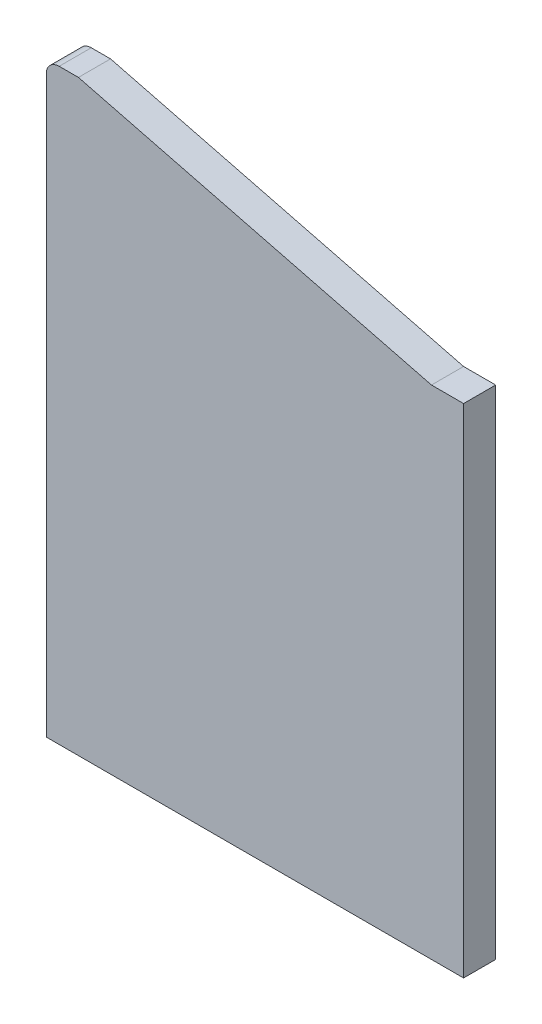
ISO-10303-21;
HEADER;
FILE_DESCRIPTION(('STEP AP214'),'2;1');
FILE_NAME('part.step','',(''),(''),'','','');
FILE_SCHEMA(('AUTOMOTIVE_DESIGN { 1 0 10303 214 1 1 1 1 }'));
ENDSEC;
DATA;
#1=APPLICATION_CONTEXT('core data for automotive mechanical design processes');
#2=APPLICATION_PROTOCOL_DEFINITION('international standard','automotive_design',2000,#1);
#3=PRODUCT_CONTEXT('',#1,'mechanical');
#4=PRODUCT('Part','Part','',(#3));
#5=PRODUCT_RELATED_PRODUCT_CATEGORY('part','',(#4));
#6=PRODUCT_DEFINITION_FORMATION('','',#4);
#7=PRODUCT_DEFINITION_CONTEXT('part definition',#1,'design');
#8=PRODUCT_DEFINITION('design','',#6,#7);
#9=PRODUCT_DEFINITION_SHAPE('','',#8);
#10=(LENGTH_UNIT() NAMED_UNIT(*) SI_UNIT(.MILLI.,.METRE.));
#11=(NAMED_UNIT(*) PLANE_ANGLE_UNIT() SI_UNIT($,.RADIAN.));
#12=(NAMED_UNIT(*) SI_UNIT($,.STERADIAN.) SOLID_ANGLE_UNIT());
#13=UNCERTAINTY_MEASURE_WITH_UNIT(LENGTH_MEASURE(1.E-05),#10,'distance_accuracy_value','');
#14=(GEOMETRIC_REPRESENTATION_CONTEXT(3) GLOBAL_UNCERTAINTY_ASSIGNED_CONTEXT((#13)) GLOBAL_UNIT_ASSIGNED_CONTEXT((#10,
#11,#12)) REPRESENTATION_CONTEXT('',''));
#15=CARTESIAN_POINT('',(0.,0.,0.));
#16=DIRECTION('',(0.,0.,1.));
#17=DIRECTION('',(1.,0.,0.));
#18=AXIS2_PLACEMENT_3D('',#15,#16,#17);
#19=CARTESIAN_POINT('',(0.,0.,10.));
#20=DIRECTION('',(1.,0.,0.));
#21=DIRECTION('',(0.,1.,0.));
#22=AXIS2_PLACEMENT_3D('',#19,#20,#21);
#23=PLANE('',#22);
#24=DIRECTION('',(0.,-1.,0.));
#25=VECTOR('',#24,1.);
#26=CARTESIAN_POINT('',(0.,0.,10.));
#27=LINE('',#26,#25);
#28=CARTESIAN_POINT('',(0.,179.,10.));
#29=VERTEX_POINT('',#28);
#30=CARTESIAN_POINT('',(0.,0.,10.));
#31=VERTEX_POINT('',#30);
#32=EDGE_CURVE('E91',#29,#31,#27,.T.);
#33=ORIENTED_EDGE('',*,*,#32,.F.);
#34=DIRECTION('',(0.,0.,-1.));
#35=VECTOR('',#34,1.);
#36=CARTESIAN_POINT('',(0.,179.,10.));
#37=LINE('',#36,#35);
#38=CARTESIAN_POINT('',(0.,179.,0.));
#39=VERTEX_POINT('',#38);
#40=EDGE_CURVE('E114',#29,#39,#37,.T.);
#41=ORIENTED_EDGE('',*,*,#40,.T.);
#42=DIRECTION('',(0.,-1.,0.));
#43=VECTOR('',#42,1.);
#44=CARTESIAN_POINT('',(0.,0.,0.));
#45=LINE('',#44,#43);
#46=CARTESIAN_POINT('',(0.,0.,0.));
#47=VERTEX_POINT('',#46);
#48=EDGE_CURVE('E112',#39,#47,#45,.T.);
#49=ORIENTED_EDGE('',*,*,#48,.T.);
#50=DIRECTION('',(0.,0.,-1.));
#51=VECTOR('',#50,1.);
#52=CARTESIAN_POINT('',(0.,0.,10.));
#53=LINE('',#52,#51);
#54=EDGE_CURVE('E106',#31,#47,#53,.T.);
#55=ORIENTED_EDGE('',*,*,#54,.F.);
#56=EDGE_LOOP('',(#33,#41,#49,#55));
#57=FACE_BOUND('',#56,.T.);
#58=ADVANCED_FACE('F33',(#57),#23,.F.);
#59=CARTESIAN_POINT('',(130.,-1.11022302462516E-13,10.));
#60=DIRECTION('',(0.,1.,0.));
#61=DIRECTION('',(-1.,0.,0.));
#62=AXIS2_PLACEMENT_3D('',#59,#60,#61);
#63=PLANE('',#62);
#64=DIRECTION('',(1.,0.,0.));
#65=VECTOR('',#64,1.);
#66=CARTESIAN_POINT('',(130.,-1.11022302462516E-13,0.));
#67=LINE('',#66,#65);
#68=CARTESIAN_POINT('',(130.,-1.11022302462516E-13,0.));
#69=VERTEX_POINT('',#68);
#70=EDGE_CURVE('E137',#47,#69,#67,.T.);
#71=ORIENTED_EDGE('',*,*,#70,.T.);
#72=DIRECTION('',(0.,0.,-1.));
#73=VECTOR('',#72,1.);
#74=CARTESIAN_POINT('',(130.,-1.11022302462516E-13,10.));
#75=LINE('',#74,#73);
#76=CARTESIAN_POINT('',(130.,-1.11022302462516E-13,10.));
#77=VERTEX_POINT('',#76);
#78=EDGE_CURVE('E108',#77,#69,#75,.T.);
#79=ORIENTED_EDGE('',*,*,#78,.F.);
#80=DIRECTION('',(1.,0.,0.));
#81=VECTOR('',#80,1.);
#82=CARTESIAN_POINT('',(130.,-1.11022302462516E-13,10.));
#83=LINE('',#82,#81);
#84=EDGE_CURVE('E94',#31,#77,#83,.T.);
#85=ORIENTED_EDGE('',*,*,#84,.F.);
#86=ORIENTED_EDGE('',*,*,#54,.T.);
#87=EDGE_LOOP('',(#71,#79,#85,#86));
#88=FACE_BOUND('',#87,.T.);
#89=ADVANCED_FACE('F105',(#88),#63,.F.);
#90=CARTESIAN_POINT('',(130.,155.,10.));
#91=DIRECTION('',(-1.,0.,0.));
#92=DIRECTION('',(0.,-1.,0.));
#93=AXIS2_PLACEMENT_3D('',#90,#91,#92);
#94=PLANE('',#93);
#95=DIRECTION('',(0.,1.,0.));
#96=VECTOR('',#95,1.);
#97=CARTESIAN_POINT('',(130.,155.,0.));
#98=LINE('',#97,#96);
#99=CARTESIAN_POINT('',(130.,155.,0.));
#100=VERTEX_POINT('',#99);
#101=EDGE_CURVE('E135',#69,#100,#98,.T.);
#102=ORIENTED_EDGE('',*,*,#101,.T.);
#103=DIRECTION('',(0.,0.,-1.));
#104=VECTOR('',#103,1.);
#105=CARTESIAN_POINT('',(130.,155.,10.));
#106=LINE('',#105,#104);
#107=CARTESIAN_POINT('',(130.,155.,10.));
#108=VERTEX_POINT('',#107);
#109=EDGE_CURVE('E117',#108,#100,#106,.T.);
#110=ORIENTED_EDGE('',*,*,#109,.F.);
#111=DIRECTION('',(0.,1.,0.));
#112=VECTOR('',#111,1.);
#113=CARTESIAN_POINT('',(130.,155.,10.));
#114=LINE('',#113,#112);
#115=EDGE_CURVE('E110',#77,#108,#114,.T.);
#116=ORIENTED_EDGE('',*,*,#115,.F.);
#117=ORIENTED_EDGE('',*,*,#78,.T.);
#118=EDGE_LOOP('',(#102,#110,#116,#117));
#119=FACE_BOUND('',#118,.T.);
#120=ADVANCED_FACE('F149',(#119),#94,.F.);
#121=CARTESIAN_POINT('',(120.,155.,10.));
#122=DIRECTION('',(0.,-1.,0.));
#123=DIRECTION('',(1.,0.,0.));
#124=AXIS2_PLACEMENT_3D('',#121,#122,#123);
#125=PLANE('',#124);
#126=DIRECTION('',(-1.,0.,0.));
#127=VECTOR('',#126,1.);
#128=CARTESIAN_POINT('',(120.,155.,0.));
#129=LINE('',#128,#127);
#130=CARTESIAN_POINT('',(120.,155.,0.));
#131=VERTEX_POINT('',#130);
#132=EDGE_CURVE('E133',#100,#131,#129,.T.);
#133=ORIENTED_EDGE('',*,*,#132,.T.);
#134=DIRECTION('',(0.,0.,-1.));
#135=VECTOR('',#134,1.);
#136=CARTESIAN_POINT('',(120.,155.,10.));
#137=LINE('',#136,#135);
#138=CARTESIAN_POINT('',(120.,155.,10.));
#139=VERTEX_POINT('',#138);
#140=EDGE_CURVE('E123',#139,#131,#137,.T.);
#141=ORIENTED_EDGE('',*,*,#140,.F.);
#142=DIRECTION('',(-1.,0.,0.));
#143=VECTOR('',#142,1.);
#144=CARTESIAN_POINT('',(120.,155.,10.));
#145=LINE('',#144,#143);
#146=EDGE_CURVE('E143',#108,#139,#145,.T.);
#147=ORIENTED_EDGE('',*,*,#146,.F.);
#148=ORIENTED_EDGE('',*,*,#109,.T.);
#149=EDGE_LOOP('',(#133,#141,#147,#148));
#150=FACE_BOUND('',#149,.T.);
#151=ADVANCED_FACE('F153',(#150),#125,.F.);
#152=CARTESIAN_POINT('',(10.,183.,10.));
#153=DIRECTION('',(-0.246679280634931,-0.969097173922942,0.));
#154=DIRECTION('',(0.969097173922942,-0.246679280634931,0.));
#155=AXIS2_PLACEMENT_3D('',#152,#153,#154);
#156=PLANE('',#155);
#157=DIRECTION('',(-0.969097173922942,0.246679280634931,0.));
#158=VECTOR('',#157,1.);
#159=CARTESIAN_POINT('',(10.,183.,0.));
#160=LINE('',#159,#158);
#161=CARTESIAN_POINT('',(10.,183.,0.));
#162=VERTEX_POINT('',#161);
#163=EDGE_CURVE('E131',#131,#162,#160,.T.);
#164=ORIENTED_EDGE('',*,*,#163,.T.);
#165=DIRECTION('',(0.,0.,-1.));
#166=VECTOR('',#165,1.);
#167=CARTESIAN_POINT('',(10.,183.,10.));
#168=LINE('',#167,#166);
#169=CARTESIAN_POINT('',(10.,183.,10.));
#170=VERTEX_POINT('',#169);
#171=EDGE_CURVE('E126',#170,#162,#168,.T.);
#172=ORIENTED_EDGE('',*,*,#171,.F.);
#173=DIRECTION('',(-0.969097173922942,0.246679280634931,0.));
#174=VECTOR('',#173,1.);
#175=CARTESIAN_POINT('',(10.,183.,10.));
#176=LINE('',#175,#174);
#177=EDGE_CURVE('E141',#139,#170,#176,.T.);
#178=ORIENTED_EDGE('',*,*,#177,.F.);
#179=ORIENTED_EDGE('',*,*,#140,.T.);
#180=EDGE_LOOP('',(#164,#172,#178,#179));
#181=FACE_BOUND('',#180,.T.);
#182=ADVANCED_FACE('F158',(#181),#156,.F.);
#183=CARTESIAN_POINT('',(0.,183.,10.));
#184=DIRECTION('',(0.,-1.,0.));
#185=DIRECTION('',(1.,0.,0.));
#186=AXIS2_PLACEMENT_3D('',#183,#184,#185);
#187=PLANE('',#186);
#188=DIRECTION('',(-1.,0.,0.));
#189=VECTOR('',#188,1.);
#190=CARTESIAN_POINT('',(0.,183.,0.));
#191=LINE('',#190,#189);
#192=CARTESIAN_POINT('',(4.00000000000003,183.,0.));
#193=VERTEX_POINT('',#192);
#194=EDGE_CURVE('E101',#162,#193,#191,.T.);
#195=ORIENTED_EDGE('',*,*,#194,.T.);
#196=DIRECTION('',(0.,0.,-1.));
#197=VECTOR('',#196,1.);
#198=CARTESIAN_POINT('',(4.00000000000003,183.,10.));
#199=LINE('',#198,#197);
#200=CARTESIAN_POINT('',(4.00000000000003,183.,10.));
#201=VERTEX_POINT('',#200);
#202=EDGE_CURVE('E41',#193,#201,#199,.F.);
#203=ORIENTED_EDGE('',*,*,#202,.T.);
#204=DIRECTION('',(-1.,0.,0.));
#205=VECTOR('',#204,1.);
#206=CARTESIAN_POINT('',(0.,183.,10.));
#207=LINE('',#206,#205);
#208=EDGE_CURVE('E129',#170,#201,#207,.T.);
#209=ORIENTED_EDGE('',*,*,#208,.F.);
#210=ORIENTED_EDGE('',*,*,#171,.T.);
#211=EDGE_LOOP('',(#195,#203,#209,#210));
#212=FACE_BOUND('',#211,.T.);
#213=ADVANCED_FACE('F161',(#212),#187,.F.);
#214=CARTESIAN_POINT('',(0.,0.,10.));
#215=DIRECTION('',(0.,0.,-1.));
#216=DIRECTION('',(-1.,0.,0.));
#217=AXIS2_PLACEMENT_3D('',#214,#215,#216);
#218=PLANE('',#217);
#219=ORIENTED_EDGE('',*,*,#208,.T.);
#220=CARTESIAN_POINT('',(4.00000000000006,179.,10.));
#221=DIRECTION('',(0.,0.,-1.));
#222=DIRECTION('',(-1.,0.,0.));
#223=AXIS2_PLACEMENT_3D('',#220,#221,#222);
#224=CIRCLE('',#223,4.);
#225=EDGE_CURVE('E11',#201,#29,#224,.F.);
#226=ORIENTED_EDGE('',*,*,#225,.T.);
#227=ORIENTED_EDGE('',*,*,#32,.T.);
#228=ORIENTED_EDGE('',*,*,#84,.T.);
#229=ORIENTED_EDGE('',*,*,#115,.T.);
#230=ORIENTED_EDGE('',*,*,#146,.T.);
#231=ORIENTED_EDGE('',*,*,#177,.T.);
#232=EDGE_LOOP('',(#219,#226,#227,#228,#229,#230,#231));
#233=FACE_BOUND('',#232,.T.);
#234=ADVANCED_FACE('F93',(#233),#218,.F.);
#235=CARTESIAN_POINT('',(0.,0.,0.));
#236=DIRECTION('',(0.,0.,-1.));
#237=DIRECTION('',(-1.,0.,0.));
#238=AXIS2_PLACEMENT_3D('',#235,#236,#237);
#239=PLANE('',#238);
#240=ORIENTED_EDGE('',*,*,#48,.F.);
#241=CARTESIAN_POINT('',(4.00000000000006,179.,0.));
#242=DIRECTION('',(0.,0.,-1.));
#243=DIRECTION('',(-1.,0.,0.));
#244=AXIS2_PLACEMENT_3D('',#241,#242,#243);
#245=CIRCLE('',#244,4.);
#246=EDGE_CURVE('E55',#39,#193,#245,.T.);
#247=ORIENTED_EDGE('',*,*,#246,.T.);
#248=ORIENTED_EDGE('',*,*,#194,.F.);
#249=ORIENTED_EDGE('',*,*,#163,.F.);
#250=ORIENTED_EDGE('',*,*,#132,.F.);
#251=ORIENTED_EDGE('',*,*,#101,.F.);
#252=ORIENTED_EDGE('',*,*,#70,.F.);
#253=EDGE_LOOP('',(#240,#247,#248,#249,#250,#251,#252));
#254=FACE_BOUND('',#253,.T.);
#255=ADVANCED_FACE('F160',(#254),#239,.T.);
#256=CARTESIAN_POINT('',(4.00000000000006,179.,10.));
#257=DIRECTION('',(0.,0.,-1.));
#258=DIRECTION('',(-1.,0.,0.));
#259=AXIS2_PLACEMENT_3D('',#256,#257,#258);
#260=CYLINDRICAL_SURFACE('',#259,4.);
#261=ORIENTED_EDGE('',*,*,#225,.F.);
#262=ORIENTED_EDGE('',*,*,#202,.F.);
#263=ORIENTED_EDGE('',*,*,#246,.F.);
#264=ORIENTED_EDGE('',*,*,#40,.F.);
#265=EDGE_LOOP('',(#261,#262,#263,#264));
#266=FACE_BOUND('',#265,.T.);
#267=ADVANCED_FACE('F35',(#266),#260,.T.);
#268=CLOSED_SHELL('',(#58,#89,#120,#151,#182,#213,#234,#255,#267));
#269=MANIFOLD_SOLID_BREP('B2',#268);
#270=ADVANCED_BREP_SHAPE_REPRESENTATION('',(#18,#269),#14);
#271=SHAPE_DEFINITION_REPRESENTATION(#9,#270);
ENDSEC;
END-ISO-10303-21;
